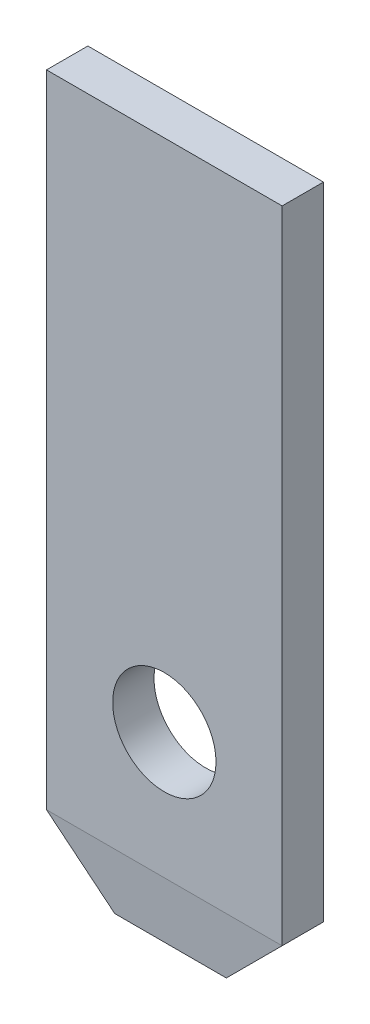
ISO-10303-21;
HEADER;
FILE_DESCRIPTION(('STEP AP214'),'2;1');
FILE_NAME('part.step','',(''),(''),'','','');
FILE_SCHEMA(('AUTOMOTIVE_DESIGN { 1 0 10303 214 1 1 1 1 }'));
ENDSEC;
DATA;
#1=APPLICATION_CONTEXT('core data for automotive mechanical design processes');
#2=APPLICATION_PROTOCOL_DEFINITION('international standard','automotive_design',2000,#1);
#3=PRODUCT_CONTEXT('',#1,'mechanical');
#4=PRODUCT('Part','Part','',(#3));
#5=PRODUCT_RELATED_PRODUCT_CATEGORY('part','',(#4));
#6=PRODUCT_DEFINITION_FORMATION('','',#4);
#7=PRODUCT_DEFINITION_CONTEXT('part definition',#1,'design');
#8=PRODUCT_DEFINITION('design','',#6,#7);
#9=PRODUCT_DEFINITION_SHAPE('','',#8);
#10=(LENGTH_UNIT() NAMED_UNIT(*) SI_UNIT(.MILLI.,.METRE.));
#11=(NAMED_UNIT(*) PLANE_ANGLE_UNIT() SI_UNIT($,.RADIAN.));
#12=(NAMED_UNIT(*) SI_UNIT($,.STERADIAN.) SOLID_ANGLE_UNIT());
#13=UNCERTAINTY_MEASURE_WITH_UNIT(LENGTH_MEASURE(1.E-05),#10,'distance_accuracy_value','');
#14=(GEOMETRIC_REPRESENTATION_CONTEXT(3) GLOBAL_UNCERTAINTY_ASSIGNED_CONTEXT((#13)) GLOBAL_UNIT_ASSIGNED_CONTEXT((#10,
#11,#12)) REPRESENTATION_CONTEXT('',''));
#15=CARTESIAN_POINT('',(0.,0.,0.));
#16=DIRECTION('',(0.,0.,1.));
#17=DIRECTION('',(1.,0.,0.));
#18=AXIS2_PLACEMENT_3D('',#15,#16,#17);
#19=CARTESIAN_POINT('',(1.425,8.5,0.25));
#20=DIRECTION('',(0.,0.,-1.));
#21=DIRECTION('',(-1.,0.,0.));
#22=AXIS2_PLACEMENT_3D('',#19,#20,#21);
#23=PLANE('',#22);
#24=DIRECTION('',(0.,-1.,0.));
#25=VECTOR('',#24,1.);
#26=CARTESIAN_POINT('',(-1.425,0.,0.25));
#27=LINE('',#26,#25);
#28=CARTESIAN_POINT('',(-1.425,8.5,0.25));
#29=VERTEX_POINT('',#28);
#30=CARTESIAN_POINT('',(-1.425,0.749999999999998,0.249999999999999));
#31=VERTEX_POINT('',#30);
#32=EDGE_CURVE('E106',#29,#31,#27,.T.);
#33=ORIENTED_EDGE('',*,*,#32,.T.);
#34=DIRECTION('',(1.,0.,0.));
#35=VECTOR('',#34,1.);
#36=CARTESIAN_POINT('',(1.425,0.750000000000025,0.25));
#37=LINE('',#36,#35);
#38=CARTESIAN_POINT('',(1.425,0.749999999999998,0.249999999999999));
#39=VERTEX_POINT('',#38);
#40=EDGE_CURVE('E92',#31,#39,#37,.T.);
#41=ORIENTED_EDGE('',*,*,#40,.T.);
#42=DIRECTION('',(0.,1.,0.));
#43=VECTOR('',#42,1.);
#44=CARTESIAN_POINT('',(1.425,0.,0.25));
#45=LINE('',#44,#43);
#46=CARTESIAN_POINT('',(1.425,8.5,0.25));
#47=VERTEX_POINT('',#46);
#48=EDGE_CURVE('E86',#39,#47,#45,.T.);
#49=ORIENTED_EDGE('',*,*,#48,.T.);
#50=DIRECTION('',(-1.,0.,0.));
#51=VECTOR('',#50,1.);
#52=CARTESIAN_POINT('',(-1.425,8.5,0.25));
#53=LINE('',#52,#51);
#54=EDGE_CURVE('E90',#47,#29,#53,.T.);
#55=ORIENTED_EDGE('',*,*,#54,.T.);
#56=EDGE_LOOP('',(#33,#41,#49,#55));
#57=FACE_BOUND('',#56,.T.);
#58=CARTESIAN_POINT('',(0.,2.275,0.25));
#59=DIRECTION('',(0.,0.,1.));
#60=DIRECTION('',(1.,0.,0.));
#61=AXIS2_PLACEMENT_3D('',#58,#59,#60);
#62=CIRCLE('',#61,0.625);
#63=CARTESIAN_POINT('',(0.625,2.275,0.25));
#64=VERTEX_POINT('',#63);
#65=EDGE_CURVE('E145',#64,#64,#62,.T.);
#66=ORIENTED_EDGE('',*,*,#65,.F.);
#67=EDGE_LOOP('',(#66));
#68=FACE_BOUND('',#67,.T.);
#69=ADVANCED_FACE('F32',(#57,#68),#23,.F.);
#70=CARTESIAN_POINT('',(1.425,8.5,-0.25));
#71=DIRECTION('',(0.,0.,-1.));
#72=DIRECTION('',(-1.,0.,0.));
#73=AXIS2_PLACEMENT_3D('',#70,#71,#72);
#74=PLANE('',#73);
#75=DIRECTION('',(0.,1.,0.));
#76=VECTOR('',#75,1.);
#77=CARTESIAN_POINT('',(1.425,0.,-0.25));
#78=LINE('',#77,#76);
#79=CARTESIAN_POINT('',(1.425,0.75,-0.25));
#80=VERTEX_POINT('',#79);
#81=CARTESIAN_POINT('',(1.425,8.5,-0.25));
#82=VERTEX_POINT('',#81);
#83=EDGE_CURVE('E110',#80,#82,#78,.T.);
#84=ORIENTED_EDGE('',*,*,#83,.F.);
#85=DIRECTION('',(-1.,0.,0.));
#86=VECTOR('',#85,1.);
#87=CARTESIAN_POINT('',(-1.425,0.75,-0.25));
#88=LINE('',#87,#86);
#89=CARTESIAN_POINT('',(-1.425,0.75,-0.25));
#90=VERTEX_POINT('',#89);
#91=EDGE_CURVE('E120',#80,#90,#88,.T.);
#92=ORIENTED_EDGE('',*,*,#91,.T.);
#93=DIRECTION('',(0.,-1.,0.));
#94=VECTOR('',#93,1.);
#95=CARTESIAN_POINT('',(-1.425,0.,-0.25));
#96=LINE('',#95,#94);
#97=CARTESIAN_POINT('',(-1.425,8.5,-0.25));
#98=VERTEX_POINT('',#97);
#99=EDGE_CURVE('E97',#98,#90,#96,.T.);
#100=ORIENTED_EDGE('',*,*,#99,.F.);
#101=DIRECTION('',(-1.,0.,0.));
#102=VECTOR('',#101,1.);
#103=CARTESIAN_POINT('',(-1.425,8.5,-0.25));
#104=LINE('',#103,#102);
#105=EDGE_CURVE('E144',#82,#98,#104,.T.);
#106=ORIENTED_EDGE('',*,*,#105,.F.);
#107=EDGE_LOOP('',(#84,#92,#100,#106));
#108=FACE_BOUND('',#107,.T.);
#109=CARTESIAN_POINT('',(0.,2.275,-0.25));
#110=DIRECTION('',(0.,0.,1.));
#111=DIRECTION('',(1.,0.,0.));
#112=AXIS2_PLACEMENT_3D('',#109,#110,#111);
#113=CIRCLE('',#112,0.625);
#114=CARTESIAN_POINT('',(0.625,2.275,-0.25));
#115=VERTEX_POINT('',#114);
#116=EDGE_CURVE('E247',#115,#115,#113,.T.);
#117=ORIENTED_EDGE('',*,*,#116,.T.);
#118=EDGE_LOOP('',(#117));
#119=FACE_BOUND('',#118,.T.);
#120=ADVANCED_FACE('F140',(#108,#119),#74,.T.);
#121=CARTESIAN_POINT('',(1.425,0.,0.25));
#122=DIRECTION('',(-1.,0.,0.));
#123=DIRECTION('',(0.,0.,1.));
#124=AXIS2_PLACEMENT_3D('',#121,#122,#123);
#125=PLANE('',#124);
#126=ORIENTED_EDGE('',*,*,#48,.F.);
#127=DIRECTION('',(0.,0.,-1.));
#128=VECTOR('',#127,1.);
#129=CARTESIAN_POINT('',(1.425,0.75,0.25));
#130=LINE('',#129,#128);
#131=EDGE_CURVE('E124',#39,#80,#130,.T.);
#132=ORIENTED_EDGE('',*,*,#131,.T.);
#133=ORIENTED_EDGE('',*,*,#83,.T.);
#134=DIRECTION('',(0.,0.,-1.));
#135=VECTOR('',#134,1.);
#136=CARTESIAN_POINT('',(1.425,8.5,0.25));
#137=LINE('',#136,#135);
#138=EDGE_CURVE('E102',#47,#82,#137,.T.);
#139=ORIENTED_EDGE('',*,*,#138,.F.);
#140=EDGE_LOOP('',(#126,#132,#133,#139));
#141=FACE_BOUND('',#140,.T.);
#142=ADVANCED_FACE('F108',(#141),#125,.F.);
#143=CARTESIAN_POINT('',(-1.425,8.5,0.25));
#144=DIRECTION('',(0.,-1.,0.));
#145=DIRECTION('',(0.,0.,-1.));
#146=AXIS2_PLACEMENT_3D('',#143,#144,#145);
#147=PLANE('',#146);
#148=ORIENTED_EDGE('',*,*,#105,.T.);
#149=DIRECTION('',(0.,0.,-1.));
#150=VECTOR('',#149,1.);
#151=CARTESIAN_POINT('',(-1.425,8.5,0.25));
#152=LINE('',#151,#150);
#153=EDGE_CURVE('E104',#29,#98,#152,.T.);
#154=ORIENTED_EDGE('',*,*,#153,.F.);
#155=ORIENTED_EDGE('',*,*,#54,.F.);
#156=ORIENTED_EDGE('',*,*,#138,.T.);
#157=EDGE_LOOP('',(#148,#154,#155,#156));
#158=FACE_BOUND('',#157,.T.);
#159=ADVANCED_FACE('F101',(#158),#147,.F.);
#160=CARTESIAN_POINT('',(-1.425,0.,0.25));
#161=DIRECTION('',(1.,0.,0.));
#162=DIRECTION('',(0.,0.,-1.));
#163=AXIS2_PLACEMENT_3D('',#160,#161,#162);
#164=PLANE('',#163);
#165=ORIENTED_EDGE('',*,*,#99,.T.);
#166=DIRECTION('',(0.,0.,1.));
#167=VECTOR('',#166,1.);
#168=CARTESIAN_POINT('',(-1.425,0.750000000000002,0.25));
#169=LINE('',#168,#167);
#170=EDGE_CURVE('E11',#90,#31,#169,.T.);
#171=ORIENTED_EDGE('',*,*,#170,.T.);
#172=ORIENTED_EDGE('',*,*,#32,.F.);
#173=ORIENTED_EDGE('',*,*,#153,.T.);
#174=EDGE_LOOP('',(#165,#171,#172,#173));
#175=FACE_BOUND('',#174,.T.);
#176=ADVANCED_FACE('F156',(#175),#164,.F.);
#177=CARTESIAN_POINT('',(-1.425,0.,0.25));
#178=DIRECTION('',(0.,1.,0.));
#179=DIRECTION('',(0.,0.,1.));
#180=AXIS2_PLACEMENT_3D('',#177,#178,#179);
#181=PLANE('',#180);
#182=DIRECTION('',(1.,0.,0.));
#183=VECTOR('',#182,1.);
#184=CARTESIAN_POINT('',(1.425,0.,-0.175));
#185=LINE('',#184,#183);
#186=CARTESIAN_POINT('',(-0.675,0.,-0.175));
#187=VERTEX_POINT('',#186);
#188=CARTESIAN_POINT('',(0.674999999999998,0.,-0.175));
#189=VERTEX_POINT('',#188);
#190=EDGE_CURVE('E114',#187,#189,#185,.T.);
#191=ORIENTED_EDGE('',*,*,#190,.T.);
#192=DIRECTION('',(0.,0.,1.));
#193=VECTOR('',#192,1.);
#194=CARTESIAN_POINT('',(0.674999999999998,0.,0.25));
#195=LINE('',#194,#193);
#196=CARTESIAN_POINT('',(0.674999999999998,0.,0.175));
#197=VERTEX_POINT('',#196);
#198=EDGE_CURVE('E54',#189,#197,#195,.T.);
#199=ORIENTED_EDGE('',*,*,#198,.T.);
#200=DIRECTION('',(-1.,0.,0.));
#201=VECTOR('',#200,1.);
#202=CARTESIAN_POINT('',(-1.425,0.,0.175));
#203=LINE('',#202,#201);
#204=CARTESIAN_POINT('',(-0.675,0.,0.175));
#205=VERTEX_POINT('',#204);
#206=EDGE_CURVE('E112',#197,#205,#203,.T.);
#207=ORIENTED_EDGE('',*,*,#206,.T.);
#208=DIRECTION('',(0.,0.,-1.));
#209=VECTOR('',#208,1.);
#210=CARTESIAN_POINT('',(-0.675,0.,0.25));
#211=LINE('',#210,#209);
#212=EDGE_CURVE('E130',#205,#187,#211,.T.);
#213=ORIENTED_EDGE('',*,*,#212,.T.);
#214=EDGE_LOOP('',(#191,#199,#207,#213));
#215=FACE_BOUND('',#214,.T.);
#216=ADVANCED_FACE('F153',(#215),#181,.F.);
#217=CARTESIAN_POINT('',(0.,2.275,0.25));
#218=DIRECTION('',(0.,0.,-1.));
#219=DIRECTION('',(-1.,0.,0.));
#220=AXIS2_PLACEMENT_3D('',#217,#218,#219);
#221=CYLINDRICAL_SURFACE('',#220,0.625);
#222=ORIENTED_EDGE('',*,*,#65,.T.);
#223=EDGE_LOOP('',(#222));
#224=FACE_BOUND('',#223,.T.);
#225=ORIENTED_EDGE('',*,*,#116,.F.);
#226=EDGE_LOOP('',(#225));
#227=FACE_BOUND('',#226,.T.);
#228=ADVANCED_FACE('F155',(#224,#227),#221,.F.);
#229=CARTESIAN_POINT('',(-1.425,0.,-0.175));
#230=DIRECTION('',(0.,-0.0995037190209989,-0.995037190209989));
#231=DIRECTION('',(0.,0.995037190209989,-0.0995037190209989));
#232=AXIS2_PLACEMENT_3D('',#229,#230,#231);
#233=PLANE('',#232);
#234=ORIENTED_EDGE('',*,*,#91,.F.);
#235=DIRECTION('',(0.7053456158586,0.705345615858597,-0.0705345615858597));
#236=VECTOR('',#235,1.);
#237=CARTESIAN_POINT('',(-0.36977611940299,-1.04477611940298,-0.0705223880597016));
#238=LINE('',#237,#236);
#239=EDGE_CURVE('E128',#80,#189,#238,.F.);
#240=ORIENTED_EDGE('',*,*,#239,.T.);
#241=ORIENTED_EDGE('',*,*,#190,.F.);
#242=DIRECTION('',(0.705345615858597,-0.7053456158586,0.07053456158586));
#243=VECTOR('',#242,1.);
#244=CARTESIAN_POINT('',(-1.04813432835821,0.373134328358209,-0.212313432835821));
#245=LINE('',#244,#243);
#246=EDGE_CURVE('E126',#187,#90,#245,.F.);
#247=ORIENTED_EDGE('',*,*,#246,.T.);
#248=EDGE_LOOP('',(#234,#240,#241,#247));
#249=FACE_BOUND('',#248,.T.);
#250=ADVANCED_FACE('F148',(#249),#233,.T.);
#251=CARTESIAN_POINT('',(1.425,0.750000000000025,0.25));
#252=DIRECTION('',(0.,0.0995037190209955,-0.99503719020999));
#253=DIRECTION('',(0.,0.99503719020999,0.0995037190209955));
#254=AXIS2_PLACEMENT_3D('',#251,#252,#253);
#255=PLANE('',#254);
#256=ORIENTED_EDGE('',*,*,#206,.F.);
#257=DIRECTION('',(0.7053456158586,0.705345615858597,0.0705345615858572));
#258=VECTOR('',#257,1.);
#259=CARTESIAN_POINT('',(1.42500000000001,0.750000000000012,0.249999999999999));
#260=LINE('',#259,#258);
#261=EDGE_CURVE('E40',#197,#39,#260,.T.);
#262=ORIENTED_EDGE('',*,*,#261,.T.);
#263=ORIENTED_EDGE('',*,*,#40,.F.);
#264=DIRECTION('',(0.705345615858597,-0.7053456158586,-0.0705345615858575));
#265=VECTOR('',#264,1.);
#266=CARTESIAN_POINT('',(-0.00708955223882178,-0.667910447761181,0.108208955223884));
#267=LINE('',#266,#265);
#268=EDGE_CURVE('E47',#31,#205,#267,.T.);
#269=ORIENTED_EDGE('',*,*,#268,.T.);
#270=EDGE_LOOP('',(#256,#262,#263,#269));
#271=FACE_BOUND('',#270,.T.);
#272=ADVANCED_FACE('F135',(#271),#255,.F.);
#273=CARTESIAN_POINT('',(1.425,0.75,0.25));
#274=DIRECTION('',(-0.707106781186546,0.707106781186549,0.));
#275=DIRECTION('',(-0.707106781186549,-0.707106781186546,0.));
#276=AXIS2_PLACEMENT_3D('',#273,#274,#275);
#277=PLANE('',#276);
#278=ORIENTED_EDGE('',*,*,#261,.F.);
#279=ORIENTED_EDGE('',*,*,#198,.F.);
#280=ORIENTED_EDGE('',*,*,#239,.F.);
#281=ORIENTED_EDGE('',*,*,#131,.F.);
#282=EDGE_LOOP('',(#278,#279,#280,#281));
#283=FACE_BOUND('',#282,.T.);
#284=ADVANCED_FACE('F137',(#283),#277,.F.);
#285=CARTESIAN_POINT('',(-0.675,0.,0.25));
#286=DIRECTION('',(0.707106781186549,0.707106781186546,0.));
#287=DIRECTION('',(-0.707106781186546,0.707106781186549,0.));
#288=AXIS2_PLACEMENT_3D('',#285,#286,#287);
#289=PLANE('',#288);
#290=ORIENTED_EDGE('',*,*,#268,.F.);
#291=ORIENTED_EDGE('',*,*,#170,.F.);
#292=ORIENTED_EDGE('',*,*,#246,.F.);
#293=ORIENTED_EDGE('',*,*,#212,.F.);
#294=EDGE_LOOP('',(#290,#291,#292,#293));
#295=FACE_BOUND('',#294,.T.);
#296=ADVANCED_FACE('F34',(#295),#289,.F.);
#297=CLOSED_SHELL('',(#69,#120,#142,#159,#176,#216,#228,#250,#272,#284,#296));
#298=MANIFOLD_SOLID_BREP('B2',#297);
#299=ADVANCED_BREP_SHAPE_REPRESENTATION('',(#18,#298),#14);
#300=SHAPE_DEFINITION_REPRESENTATION(#9,#299);
ENDSEC;
END-ISO-10303-21;
